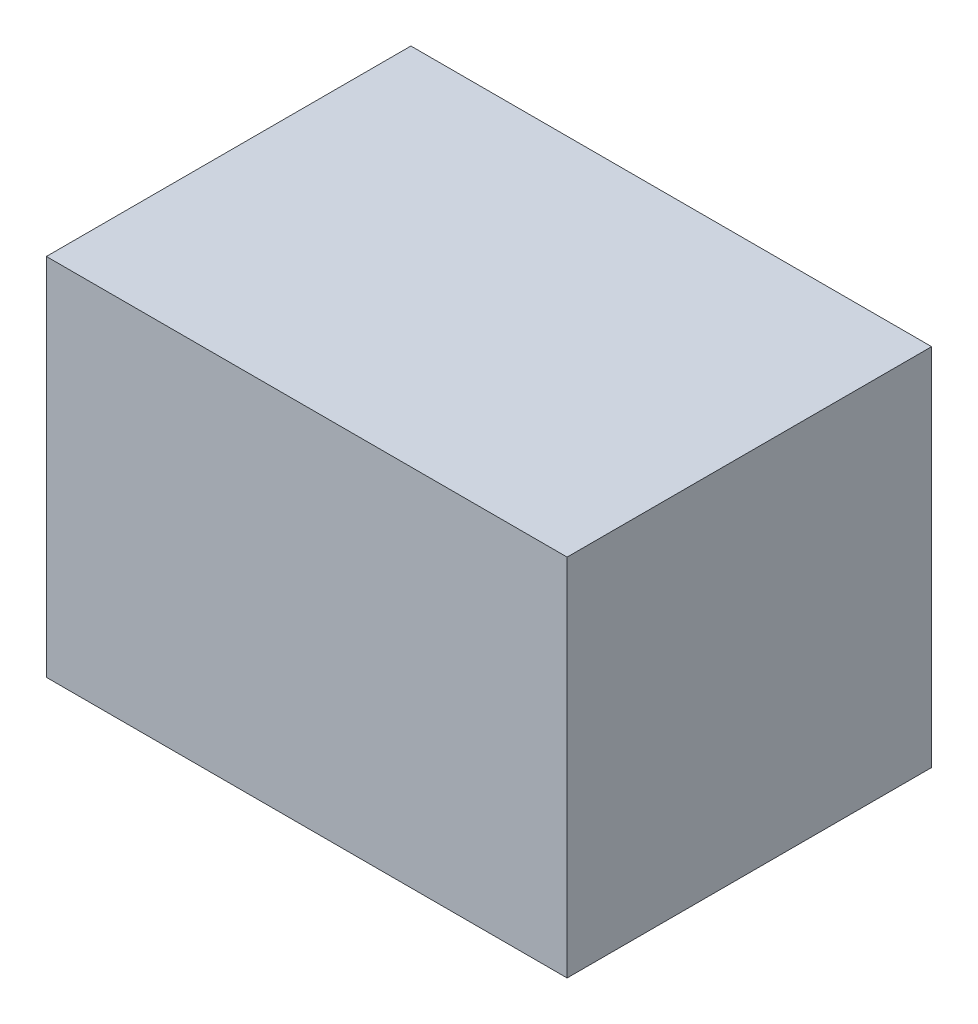
ISO-10303-21;
HEADER;
FILE_DESCRIPTION(('STEP AP214'),'2;1');
FILE_NAME('part.step','',(''),(''),'','','');
FILE_SCHEMA(('AUTOMOTIVE_DESIGN { 1 0 10303 214 1 1 1 1 }'));
ENDSEC;
DATA;
#1=APPLICATION_CONTEXT('core data for automotive mechanical design processes');
#2=APPLICATION_PROTOCOL_DEFINITION('international standard','automotive_design',2000,#1);
#3=PRODUCT_CONTEXT('',#1,'mechanical');
#4=PRODUCT('Part','Part','',(#3));
#5=PRODUCT_RELATED_PRODUCT_CATEGORY('part','',(#4));
#6=PRODUCT_DEFINITION_FORMATION('','',#4);
#7=PRODUCT_DEFINITION_CONTEXT('part definition',#1,'design');
#8=PRODUCT_DEFINITION('design','',#6,#7);
#9=PRODUCT_DEFINITION_SHAPE('','',#8);
#10=(LENGTH_UNIT() NAMED_UNIT(*) SI_UNIT(.MILLI.,.METRE.));
#11=(NAMED_UNIT(*) PLANE_ANGLE_UNIT() SI_UNIT($,.RADIAN.));
#12=(NAMED_UNIT(*) SI_UNIT($,.STERADIAN.) SOLID_ANGLE_UNIT());
#13=UNCERTAINTY_MEASURE_WITH_UNIT(LENGTH_MEASURE(1.E-05),#10,'distance_accuracy_value','');
#14=(GEOMETRIC_REPRESENTATION_CONTEXT(3) GLOBAL_UNCERTAINTY_ASSIGNED_CONTEXT((#13)) GLOBAL_UNIT_ASSIGNED_CONTEXT((#10,
#11,#12)) REPRESENTATION_CONTEXT('',''));
#15=CARTESIAN_POINT('',(0.,0.,0.));
#16=DIRECTION('',(0.,0.,1.));
#17=DIRECTION('',(1.,0.,0.));
#18=AXIS2_PLACEMENT_3D('',#15,#16,#17);
#19=CARTESIAN_POINT('',(-2.54,0.,0.));
#20=DIRECTION('',(0.,-1.,0.));
#21=DIRECTION('',(0.,0.,-1.));
#22=AXIS2_PLACEMENT_3D('',#19,#20,#21);
#23=PLANE('',#22);
#24=DIRECTION('',(1.,0.,0.));
#25=VECTOR('',#24,1.);
#26=CARTESIAN_POINT('',(-2.54,0.,-1.1));
#27=LINE('',#26,#25);
#28=CARTESIAN_POINT('',(12.45,0.,-1.1));
#29=VERTEX_POINT('',#28);
#30=CARTESIAN_POINT('',(12.95,0.,-1.1));
#31=VERTEX_POINT('',#30);
#32=EDGE_CURVE('E115',#29,#31,#27,.T.);
#33=ORIENTED_EDGE('',*,*,#32,.F.);
#34=DIRECTION('',(0.,0.,1.));
#35=VECTOR('',#34,1.);
#36=CARTESIAN_POINT('',(12.45,0.,0.));
#37=LINE('',#36,#35);
#38=CARTESIAN_POINT('',(12.45,0.,-0.75));
#39=VERTEX_POINT('',#38);
#40=EDGE_CURVE('E27',#29,#39,#37,.T.);
#41=ORIENTED_EDGE('',*,*,#40,.T.);
#42=DIRECTION('',(1.,0.,0.));
#43=VECTOR('',#42,1.);
#44=CARTESIAN_POINT('',(-2.54,0.,-0.75));
#45=LINE('',#44,#43);
#46=CARTESIAN_POINT('',(12.95,0.,-0.75));
#47=VERTEX_POINT('',#46);
#48=EDGE_CURVE('E95',#39,#47,#45,.T.);
#49=ORIENTED_EDGE('',*,*,#48,.T.);
#50=DIRECTION('',(0.,0.,1.));
#51=VECTOR('',#50,1.);
#52=CARTESIAN_POINT('',(12.95,0.,0.));
#53=LINE('',#52,#51);
#54=EDGE_CURVE('E74',#31,#47,#53,.T.);
#55=ORIENTED_EDGE('',*,*,#54,.F.);
#56=EDGE_LOOP('',(#33,#41,#49,#55));
#57=FACE_BOUND('',#56,.T.);
#58=ADVANCED_FACE('F16',(#57),#23,.F.);
#59=CARTESIAN_POINT('',(-2.54,-0.35,0.));
#60=DIRECTION('',(0.,-1.,0.));
#61=DIRECTION('',(0.,0.,-1.));
#62=AXIS2_PLACEMENT_3D('',#59,#60,#61);
#63=PLANE('',#62);
#64=DIRECTION('',(1.,0.,0.));
#65=VECTOR('',#64,1.);
#66=CARTESIAN_POINT('',(-2.54,-0.35,-1.1));
#67=LINE('',#66,#65);
#68=CARTESIAN_POINT('',(12.45,-0.35,-1.1));
#69=VERTEX_POINT('',#68);
#70=CARTESIAN_POINT('',(12.95,-0.35,-1.1));
#71=VERTEX_POINT('',#70);
#72=EDGE_CURVE('E92',#69,#71,#67,.T.);
#73=ORIENTED_EDGE('',*,*,#72,.T.);
#74=DIRECTION('',(0.,0.,1.));
#75=VECTOR('',#74,1.);
#76=CARTESIAN_POINT('',(12.95,-0.35,0.));
#77=LINE('',#76,#75);
#78=CARTESIAN_POINT('',(12.95,-0.35,-0.75));
#79=VERTEX_POINT('',#78);
#80=EDGE_CURVE('E65',#71,#79,#77,.T.);
#81=ORIENTED_EDGE('',*,*,#80,.T.);
#82=DIRECTION('',(1.,0.,0.));
#83=VECTOR('',#82,1.);
#84=CARTESIAN_POINT('',(-2.54,-0.35,-0.75));
#85=LINE('',#84,#83);
#86=CARTESIAN_POINT('',(12.45,-0.35,-0.75));
#87=VERTEX_POINT('',#86);
#88=EDGE_CURVE('E85',#87,#79,#85,.T.);
#89=ORIENTED_EDGE('',*,*,#88,.F.);
#90=DIRECTION('',(0.,0.,1.));
#91=VECTOR('',#90,1.);
#92=CARTESIAN_POINT('',(12.45,-0.35,0.));
#93=LINE('',#92,#91);
#94=EDGE_CURVE('E11',#69,#87,#93,.T.);
#95=ORIENTED_EDGE('',*,*,#94,.F.);
#96=EDGE_LOOP('',(#73,#81,#89,#95));
#97=FACE_BOUND('',#96,.T.);
#98=ADVANCED_FACE('F90',(#97),#63,.T.);
#99=CARTESIAN_POINT('',(12.45,-0.35,0.));
#100=DIRECTION('',(-1.,0.,0.));
#101=DIRECTION('',(0.,0.,1.));
#102=AXIS2_PLACEMENT_3D('',#99,#100,#101);
#103=PLANE('',#102);
#104=ORIENTED_EDGE('',*,*,#40,.F.);
#105=DIRECTION('',(0.,1.,0.));
#106=VECTOR('',#105,1.);
#107=CARTESIAN_POINT('',(12.45,-0.35,-1.1));
#108=LINE('',#107,#106);
#109=EDGE_CURVE('E104',#69,#29,#108,.T.);
#110=ORIENTED_EDGE('',*,*,#109,.F.);
#111=ORIENTED_EDGE('',*,*,#94,.T.);
#112=DIRECTION('',(0.,1.,0.));
#113=VECTOR('',#112,1.);
#114=CARTESIAN_POINT('',(12.45,-0.35,-0.75));
#115=LINE('',#114,#113);
#116=EDGE_CURVE('E87',#87,#39,#115,.T.);
#117=ORIENTED_EDGE('',*,*,#116,.T.);
#118=EDGE_LOOP('',(#104,#110,#111,#117));
#119=FACE_BOUND('',#118,.T.);
#120=ADVANCED_FACE('F128',(#119),#103,.T.);
#121=CARTESIAN_POINT('',(-2.54,-0.35,-0.75));
#122=DIRECTION('',(0.,0.,1.));
#123=DIRECTION('',(1.,0.,0.));
#124=AXIS2_PLACEMENT_3D('',#121,#122,#123);
#125=PLANE('',#124);
#126=ORIENTED_EDGE('',*,*,#48,.F.);
#127=ORIENTED_EDGE('',*,*,#116,.F.);
#128=ORIENTED_EDGE('',*,*,#88,.T.);
#129=DIRECTION('',(0.,1.,0.));
#130=VECTOR('',#129,1.);
#131=CARTESIAN_POINT('',(12.95,-0.35,-0.75));
#132=LINE('',#131,#130);
#133=EDGE_CURVE('E20',#79,#47,#132,.T.);
#134=ORIENTED_EDGE('',*,*,#133,.T.);
#135=EDGE_LOOP('',(#126,#127,#128,#134));
#136=FACE_BOUND('',#135,.T.);
#137=ADVANCED_FACE('F18',(#136),#125,.T.);
#138=CARTESIAN_POINT('',(12.95,-0.35,0.));
#139=DIRECTION('',(-1.,0.,0.));
#140=DIRECTION('',(0.,0.,1.));
#141=AXIS2_PLACEMENT_3D('',#138,#139,#140);
#142=PLANE('',#141);
#143=ORIENTED_EDGE('',*,*,#54,.T.);
#144=ORIENTED_EDGE('',*,*,#133,.F.);
#145=ORIENTED_EDGE('',*,*,#80,.F.);
#146=DIRECTION('',(0.,1.,0.));
#147=VECTOR('',#146,1.);
#148=CARTESIAN_POINT('',(12.95,-0.35,-1.1));
#149=LINE('',#148,#147);
#150=EDGE_CURVE('E119',#71,#31,#149,.T.);
#151=ORIENTED_EDGE('',*,*,#150,.T.);
#152=EDGE_LOOP('',(#143,#144,#145,#151));
#153=FACE_BOUND('',#152,.T.);
#154=ADVANCED_FACE('F97',(#153),#142,.F.);
#155=CARTESIAN_POINT('',(-2.54,-0.35,-1.1));
#156=DIRECTION('',(0.,0.,1.));
#157=DIRECTION('',(1.,0.,0.));
#158=AXIS2_PLACEMENT_3D('',#155,#156,#157);
#159=PLANE('',#158);
#160=ORIENTED_EDGE('',*,*,#32,.T.);
#161=ORIENTED_EDGE('',*,*,#150,.F.);
#162=ORIENTED_EDGE('',*,*,#72,.F.);
#163=ORIENTED_EDGE('',*,*,#109,.T.);
#164=EDGE_LOOP('',(#160,#161,#162,#163));
#165=FACE_BOUND('',#164,.T.);
#166=ADVANCED_FACE('F126',(#165),#159,.F.);
#167=CLOSED_SHELL('',(#58,#98,#120,#137,#154,#166));
#168=MANIFOLD_SOLID_BREP('B1',#167);
#169=ADVANCED_BREP_SHAPE_REPRESENTATION('',(#18,#168),#14);
#170=SHAPE_DEFINITION_REPRESENTATION(#9,#169);
ENDSEC;
END-ISO-10303-21;
